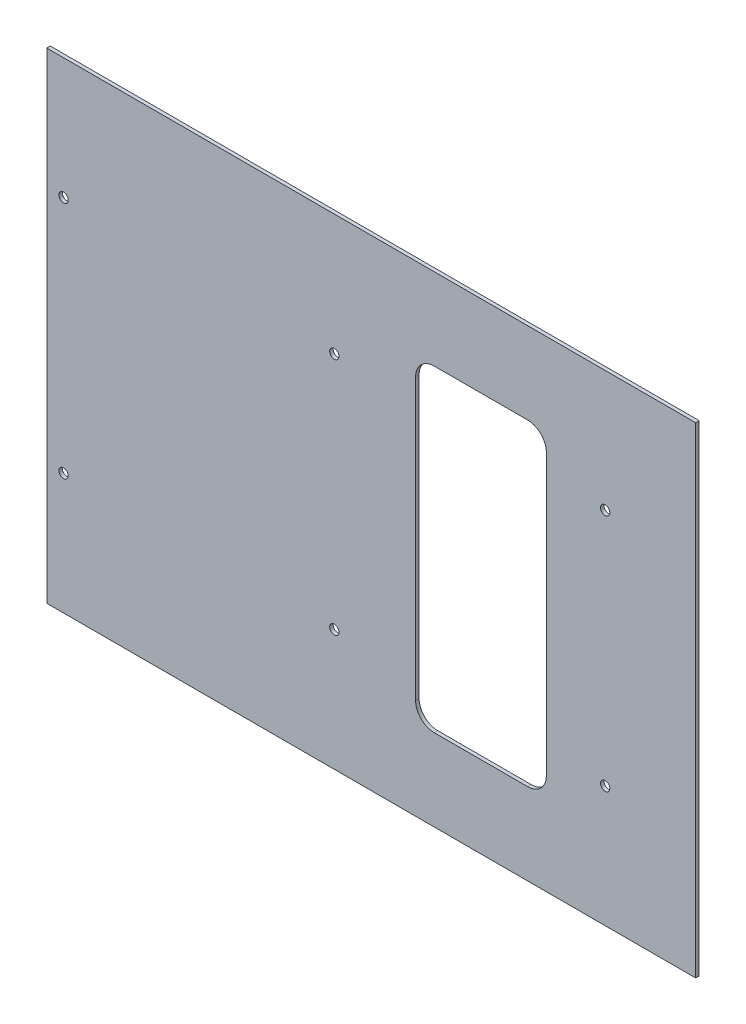
ISO-10303-21;
HEADER;
FILE_DESCRIPTION(('STEP AP214'),'2;1');
FILE_NAME('part.step','',(''),(''),'','','');
FILE_SCHEMA(('AUTOMOTIVE_DESIGN { 1 0 10303 214 1 1 1 1 }'));
ENDSEC;
DATA;
#1=APPLICATION_CONTEXT('core data for automotive mechanical design processes');
#2=APPLICATION_PROTOCOL_DEFINITION('international standard','automotive_design',2000,#1);
#3=PRODUCT_CONTEXT('',#1,'mechanical');
#4=PRODUCT('Part','Part','',(#3));
#5=PRODUCT_RELATED_PRODUCT_CATEGORY('part','',(#4));
#6=PRODUCT_DEFINITION_FORMATION('','',#4);
#7=PRODUCT_DEFINITION_CONTEXT('part definition',#1,'design');
#8=PRODUCT_DEFINITION('design','',#6,#7);
#9=PRODUCT_DEFINITION_SHAPE('','',#8);
#10=(LENGTH_UNIT() NAMED_UNIT(*) SI_UNIT(.MILLI.,.METRE.));
#11=(NAMED_UNIT(*) PLANE_ANGLE_UNIT() SI_UNIT($,.RADIAN.));
#12=(NAMED_UNIT(*) SI_UNIT($,.STERADIAN.) SOLID_ANGLE_UNIT());
#13=UNCERTAINTY_MEASURE_WITH_UNIT(LENGTH_MEASURE(1.E-05),#10,'distance_accuracy_value','');
#14=(GEOMETRIC_REPRESENTATION_CONTEXT(3) GLOBAL_UNCERTAINTY_ASSIGNED_CONTEXT((#13)) GLOBAL_UNIT_ASSIGNED_CONTEXT((#10,
#11,#12)) REPRESENTATION_CONTEXT('',''));
#15=CARTESIAN_POINT('',(0.,0.,0.));
#16=DIRECTION('',(0.,0.,1.));
#17=DIRECTION('',(1.,0.,0.));
#18=AXIS2_PLACEMENT_3D('',#15,#16,#17);
#19=CARTESIAN_POINT('',(-393.700000000001,-235.425000000004,4.7625));
#20=DIRECTION('',(-1.,0.,0.));
#21=DIRECTION('',(0.,0.,1.));
#22=AXIS2_PLACEMENT_3D('',#19,#20,#21);
#23=PLANE('',#22);
#24=DIRECTION('',(0.,1.,0.));
#25=VECTOR('',#24,1.);
#26=CARTESIAN_POINT('',(-393.700000000001,-235.425000000004,0.));
#27=LINE('',#26,#25);
#28=CARTESIAN_POINT('',(-393.700000000001,-235.425000000004,0.));
#29=VERTEX_POINT('',#28);
#30=CARTESIAN_POINT('',(-393.700000000001,418.624999999996,0.));
#31=VERTEX_POINT('',#30);
#32=EDGE_CURVE('E145',#29,#31,#27,.T.);
#33=ORIENTED_EDGE('',*,*,#32,.T.);
#34=DIRECTION('',(0.,0.,-1.));
#35=VECTOR('',#34,1.);
#36=CARTESIAN_POINT('',(-393.700000000001,418.624999999996,4.7625));
#37=LINE('',#36,#35);
#38=CARTESIAN_POINT('',(-393.700000000001,418.624999999996,4.7625));
#39=VERTEX_POINT('',#38);
#40=EDGE_CURVE('E126',#39,#31,#37,.T.);
#41=ORIENTED_EDGE('',*,*,#40,.F.);
#42=DIRECTION('',(0.,1.,0.));
#43=VECTOR('',#42,1.);
#44=CARTESIAN_POINT('',(-393.700000000001,-235.425000000004,4.7625));
#45=LINE('',#44,#43);
#46=CARTESIAN_POINT('',(-393.700000000001,-235.425000000004,4.7625));
#47=VERTEX_POINT('',#46);
#48=EDGE_CURVE('E133',#47,#39,#45,.T.);
#49=ORIENTED_EDGE('',*,*,#48,.F.);
#50=DIRECTION('',(0.,0.,-1.));
#51=VECTOR('',#50,1.);
#52=CARTESIAN_POINT('',(-393.700000000001,-235.425000000004,4.7625));
#53=LINE('',#52,#51);
#54=EDGE_CURVE('E254',#47,#29,#53,.T.);
#55=ORIENTED_EDGE('',*,*,#54,.T.);
#56=EDGE_LOOP('',(#33,#41,#49,#55));
#57=FACE_BOUND('',#56,.T.);
#58=ADVANCED_FACE('F33',(#57),#23,.F.);
#59=CARTESIAN_POINT('',(-393.700000000001,418.624999999996,4.7625));
#60=DIRECTION('',(0.,-1.,0.));
#61=DIRECTION('',(1.,0.,0.));
#62=AXIS2_PLACEMENT_3D('',#59,#60,#61);
#63=PLANE('',#62);
#64=DIRECTION('',(-1.,0.,0.));
#65=VECTOR('',#64,1.);
#66=CARTESIAN_POINT('',(-393.700000000001,418.624999999996,0.));
#67=LINE('',#66,#65);
#68=CARTESIAN_POINT('',(-1276.35,418.624999999996,0.));
#69=VERTEX_POINT('',#68);
#70=EDGE_CURVE('E256',#31,#69,#67,.T.);
#71=ORIENTED_EDGE('',*,*,#70,.T.);
#72=DIRECTION('',(0.,0.,-1.));
#73=VECTOR('',#72,1.);
#74=CARTESIAN_POINT('',(-1276.35,418.624999999996,4.7625));
#75=LINE('',#74,#73);
#76=CARTESIAN_POINT('',(-1276.35,418.624999999996,4.7625));
#77=VERTEX_POINT('',#76);
#78=EDGE_CURVE('E129',#77,#69,#75,.T.);
#79=ORIENTED_EDGE('',*,*,#78,.F.);
#80=DIRECTION('',(-1.,0.,0.));
#81=VECTOR('',#80,1.);
#82=CARTESIAN_POINT('',(-393.700000000001,418.624999999996,4.7625));
#83=LINE('',#82,#81);
#84=EDGE_CURVE('E122',#39,#77,#83,.T.);
#85=ORIENTED_EDGE('',*,*,#84,.F.);
#86=ORIENTED_EDGE('',*,*,#40,.T.);
#87=EDGE_LOOP('',(#71,#79,#85,#86));
#88=FACE_BOUND('',#87,.T.);
#89=ADVANCED_FACE('F124',(#88),#63,.F.);
#90=CARTESIAN_POINT('',(-1276.35,-235.425000000004,4.7625));
#91=DIRECTION('',(1.,0.,0.));
#92=DIRECTION('',(0.,0.,-1.));
#93=AXIS2_PLACEMENT_3D('',#90,#91,#92);
#94=PLANE('',#93);
#95=DIRECTION('',(0.,-1.,0.));
#96=VECTOR('',#95,1.);
#97=CARTESIAN_POINT('',(-1276.35,-235.425000000004,0.));
#98=LINE('',#97,#96);
#99=CARTESIAN_POINT('',(-1276.35,-235.425000000004,0.));
#100=VERTEX_POINT('',#99);
#101=EDGE_CURVE('E258',#69,#100,#98,.T.);
#102=ORIENTED_EDGE('',*,*,#101,.T.);
#103=DIRECTION('',(0.,0.,-1.));
#104=VECTOR('',#103,1.);
#105=CARTESIAN_POINT('',(-1276.35,-235.425000000004,4.7625));
#106=LINE('',#105,#104);
#107=CARTESIAN_POINT('',(-1276.35,-235.425000000004,4.7625));
#108=VERTEX_POINT('',#107);
#109=EDGE_CURVE('E150',#108,#100,#106,.T.);
#110=ORIENTED_EDGE('',*,*,#109,.F.);
#111=DIRECTION('',(0.,-1.,0.));
#112=VECTOR('',#111,1.);
#113=CARTESIAN_POINT('',(-1276.35,-235.425000000004,4.7625));
#114=LINE('',#113,#112);
#115=EDGE_CURVE('E132',#77,#108,#114,.T.);
#116=ORIENTED_EDGE('',*,*,#115,.F.);
#117=ORIENTED_EDGE('',*,*,#78,.T.);
#118=EDGE_LOOP('',(#102,#110,#116,#117));
#119=FACE_BOUND('',#118,.T.);
#120=ADVANCED_FACE('F270',(#119),#94,.F.);
#121=CARTESIAN_POINT('',(-393.700000000001,-235.425000000004,4.7625));
#122=DIRECTION('',(0.,1.,0.));
#123=DIRECTION('',(-1.,0.,0.));
#124=AXIS2_PLACEMENT_3D('',#121,#122,#123);
#125=PLANE('',#124);
#126=DIRECTION('',(1.,0.,0.));
#127=VECTOR('',#126,1.);
#128=CARTESIAN_POINT('',(-393.700000000001,-235.425000000004,0.));
#129=LINE('',#128,#127);
#130=EDGE_CURVE('E142',#100,#29,#129,.T.);
#131=ORIENTED_EDGE('',*,*,#130,.T.);
#132=ORIENTED_EDGE('',*,*,#54,.F.);
#133=DIRECTION('',(1.,0.,0.));
#134=VECTOR('',#133,1.);
#135=CARTESIAN_POINT('',(-393.700000000001,-235.425000000004,4.7625));
#136=LINE('',#135,#134);
#137=EDGE_CURVE('E138',#108,#47,#136,.T.);
#138=ORIENTED_EDGE('',*,*,#137,.F.);
#139=ORIENTED_EDGE('',*,*,#109,.T.);
#140=EDGE_LOOP('',(#131,#132,#138,#139));
#141=FACE_BOUND('',#140,.T.);
#142=ADVANCED_FACE('F265',(#141),#125,.F.);
#143=CARTESIAN_POINT('',(-393.700000000001,418.624999999996,4.7625));
#144=DIRECTION('',(0.,0.,1.));
#145=DIRECTION('',(1.,0.,0.));
#146=AXIS2_PLACEMENT_3D('',#143,#144,#145);
#147=PLANE('',#146);
#148=DIRECTION('',(0.,1.,0.));
#149=VECTOR('',#148,1.);
#150=CARTESIAN_POINT('',(-596.900000000001,307.499999999996,4.7625));
#151=LINE('',#150,#149);
#152=CARTESIAN_POINT('',(-596.900000000001,-98.900000000004,4.7625));
#153=VERTEX_POINT('',#152);
#154=CARTESIAN_POINT('',(-596.900000000001,282.099999999996,4.7625));
#155=VERTEX_POINT('',#154);
#156=EDGE_CURVE('E186',#153,#155,#151,.T.);
#157=ORIENTED_EDGE('',*,*,#156,.F.);
#158=CARTESIAN_POINT('',(-622.300000000001,-98.9000000000041,4.7625));
#159=DIRECTION('',(0.,0.,1.));
#160=DIRECTION('',(1.,0.,0.));
#161=AXIS2_PLACEMENT_3D('',#158,#159,#160);
#162=CIRCLE('',#161,25.4);
#163=CARTESIAN_POINT('',(-622.300000000001,-124.300000000004,4.7625));
#164=VERTEX_POINT('',#163);
#165=EDGE_CURVE('E174',#153,#164,#162,.F.);
#166=ORIENTED_EDGE('',*,*,#165,.T.);
#167=DIRECTION('',(1.,0.,0.));
#168=VECTOR('',#167,1.);
#169=CARTESIAN_POINT('',(-596.900000000001,-124.300000000004,4.7625));
#170=LINE('',#169,#168);
#171=CARTESIAN_POINT('',(-749.300000000001,-124.300000000004,4.7625));
#172=VERTEX_POINT('',#171);
#173=EDGE_CURVE('E205',#172,#164,#170,.T.);
#174=ORIENTED_EDGE('',*,*,#173,.F.);
#175=CARTESIAN_POINT('',(-749.300000000001,-98.9000000000041,4.7625));
#176=DIRECTION('',(0.,0.,1.));
#177=DIRECTION('',(1.,0.,0.));
#178=AXIS2_PLACEMENT_3D('',#175,#176,#177);
#179=CIRCLE('',#178,25.4);
#180=CARTESIAN_POINT('',(-774.700000000001,-98.9000000000042,4.7625));
#181=VERTEX_POINT('',#180);
#182=EDGE_CURVE('E170',#172,#181,#179,.F.);
#183=ORIENTED_EDGE('',*,*,#182,.T.);
#184=DIRECTION('',(0.,-1.,0.));
#185=VECTOR('',#184,1.);
#186=CARTESIAN_POINT('',(-774.700000000001,307.499999999996,4.7625));
#187=LINE('',#186,#185);
#188=CARTESIAN_POINT('',(-774.700000000001,282.099999999996,4.7625));
#189=VERTEX_POINT('',#188);
#190=EDGE_CURVE('E212',#189,#181,#187,.T.);
#191=ORIENTED_EDGE('',*,*,#190,.F.);
#192=CARTESIAN_POINT('',(-749.300000000001,282.099999999996,4.7625));
#193=DIRECTION('',(0.,0.,1.));
#194=DIRECTION('',(1.,0.,0.));
#195=AXIS2_PLACEMENT_3D('',#192,#193,#194);
#196=CIRCLE('',#195,25.4);
#197=CARTESIAN_POINT('',(-749.300000000001,307.499999999996,4.7625));
#198=VERTEX_POINT('',#197);
#199=EDGE_CURVE('E178',#189,#198,#196,.F.);
#200=ORIENTED_EDGE('',*,*,#199,.T.);
#201=DIRECTION('',(-1.,0.,0.));
#202=VECTOR('',#201,1.);
#203=CARTESIAN_POINT('',(-596.900000000001,307.499999999996,4.7625));
#204=LINE('',#203,#202);
#205=CARTESIAN_POINT('',(-622.300000000001,307.499999999996,4.7625));
#206=VERTEX_POINT('',#205);
#207=EDGE_CURVE('E187',#206,#198,#204,.T.);
#208=ORIENTED_EDGE('',*,*,#207,.F.);
#209=CARTESIAN_POINT('',(-622.300000000001,282.099999999996,4.7625));
#210=DIRECTION('',(0.,0.,1.));
#211=DIRECTION('',(1.,0.,0.));
#212=AXIS2_PLACEMENT_3D('',#209,#210,#211);
#213=CIRCLE('',#212,25.4);
#214=EDGE_CURVE('E41',#206,#155,#213,.F.);
#215=ORIENTED_EDGE('',*,*,#214,.T.);
#216=EDGE_LOOP('',(#157,#166,#174,#183,#191,#200,#208,#215));
#217=FACE_BOUND('',#216,.T.);
#218=CARTESIAN_POINT('',(-1253.49,253.999999999993,4.7625));
#219=DIRECTION('',(0.,0.,-1.));
#220=DIRECTION('',(-1.,0.,0.));
#221=AXIS2_PLACEMENT_3D('',#218,#219,#220);
#222=CIRCLE('',#221,6.35000000000017);
#223=CARTESIAN_POINT('',(-1259.84,253.999999999993,4.7625));
#224=VERTEX_POINT('',#223);
#225=EDGE_CURVE('E217',#224,#224,#222,.T.);
#226=ORIENTED_EDGE('',*,*,#225,.T.);
#227=EDGE_LOOP('',(#226));
#228=FACE_BOUND('',#227,.T.);
#229=CARTESIAN_POINT('',(-1253.49,-70.8000000000146,4.7625));
#230=DIRECTION('',(0.,0.,-1.));
#231=DIRECTION('',(-1.,0.,0.));
#232=AXIS2_PLACEMENT_3D('',#229,#230,#231);
#233=CIRCLE('',#232,6.35000000000016);
#234=CARTESIAN_POINT('',(-1259.84,-70.8000000000146,4.7625));
#235=VERTEX_POINT('',#234);
#236=EDGE_CURVE('E223',#235,#235,#233,.T.);
#237=ORIENTED_EDGE('',*,*,#236,.T.);
#238=EDGE_LOOP('',(#237));
#239=FACE_BOUND('',#238,.T.);
#240=CARTESIAN_POINT('',(-885.190000000002,-70.8000000000146,4.7625));
#241=DIRECTION('',(0.,0.,-1.));
#242=DIRECTION('',(-1.,0.,0.));
#243=AXIS2_PLACEMENT_3D('',#240,#241,#242);
#244=CIRCLE('',#243,6.35000000000006);
#245=CARTESIAN_POINT('',(-891.540000000002,-70.8000000000146,4.7625));
#246=VERTEX_POINT('',#245);
#247=EDGE_CURVE('E229',#246,#246,#244,.T.);
#248=ORIENTED_EDGE('',*,*,#247,.T.);
#249=EDGE_LOOP('',(#248));
#250=FACE_BOUND('',#249,.T.);
#251=CARTESIAN_POINT('',(-885.19,253.999999999993,4.7625));
#252=DIRECTION('',(0.,0.,-1.));
#253=DIRECTION('',(-1.,0.,0.));
#254=AXIS2_PLACEMENT_3D('',#251,#252,#253);
#255=CIRCLE('',#254,6.34999999999994);
#256=CARTESIAN_POINT('',(-891.54,253.999999999993,4.7625));
#257=VERTEX_POINT('',#256);
#258=EDGE_CURVE('E235',#257,#257,#255,.T.);
#259=ORIENTED_EDGE('',*,*,#258,.T.);
#260=EDGE_LOOP('',(#259));
#261=FACE_BOUND('',#260,.T.);
#262=CARTESIAN_POINT('',(-516.890000000002,-70.8000000000146,4.7625));
#263=DIRECTION('',(0.,0.,-1.));
#264=DIRECTION('',(-1.,0.,0.));
#265=AXIS2_PLACEMENT_3D('',#262,#263,#264);
#266=CIRCLE('',#265,6.34999999999994);
#267=CARTESIAN_POINT('',(-523.240000000002,-70.8000000000146,4.7625));
#268=VERTEX_POINT('',#267);
#269=EDGE_CURVE('E241',#268,#268,#266,.T.);
#270=ORIENTED_EDGE('',*,*,#269,.T.);
#271=EDGE_LOOP('',(#270));
#272=FACE_BOUND('',#271,.T.);
#273=CARTESIAN_POINT('',(-516.89,253.999999999993,4.7625));
#274=DIRECTION('',(0.,0.,-1.));
#275=DIRECTION('',(-1.,0.,0.));
#276=AXIS2_PLACEMENT_3D('',#273,#274,#275);
#277=CIRCLE('',#276,6.34999999999994);
#278=CARTESIAN_POINT('',(-523.24,253.999999999993,4.7625));
#279=VERTEX_POINT('',#278);
#280=EDGE_CURVE('E247',#279,#279,#277,.T.);
#281=ORIENTED_EDGE('',*,*,#280,.T.);
#282=EDGE_LOOP('',(#281));
#283=FACE_BOUND('',#282,.T.);
#284=ORIENTED_EDGE('',*,*,#48,.T.);
#285=ORIENTED_EDGE('',*,*,#84,.T.);
#286=ORIENTED_EDGE('',*,*,#115,.T.);
#287=ORIENTED_EDGE('',*,*,#137,.T.);
#288=EDGE_LOOP('',(#284,#285,#286,#287));
#289=FACE_BOUND('',#288,.T.);
#290=ADVANCED_FACE('F136',(#217,#228,#239,#250,#261,#272,#283,#289),#147,.T.);
#291=CARTESIAN_POINT('',(-393.700000000001,418.624999999996,0.));
#292=DIRECTION('',(0.,0.,1.));
#293=DIRECTION('',(1.,0.,0.));
#294=AXIS2_PLACEMENT_3D('',#291,#292,#293);
#295=PLANE('',#294);
#296=DIRECTION('',(0.,-1.,0.));
#297=VECTOR('',#296,1.);
#298=CARTESIAN_POINT('',(-774.700000000001,307.499999999996,0.));
#299=LINE('',#298,#297);
#300=CARTESIAN_POINT('',(-774.700000000001,282.099999999996,0.));
#301=VERTEX_POINT('',#300);
#302=CARTESIAN_POINT('',(-774.700000000001,-98.9000000000042,0.));
#303=VERTEX_POINT('',#302);
#304=EDGE_CURVE('E199',#301,#303,#299,.T.);
#305=ORIENTED_EDGE('',*,*,#304,.T.);
#306=CARTESIAN_POINT('',(-749.300000000001,-98.9000000000041,0.));
#307=DIRECTION('',(0.,0.,1.));
#308=DIRECTION('',(1.,0.,0.));
#309=AXIS2_PLACEMENT_3D('',#306,#307,#308);
#310=CIRCLE('',#309,25.4);
#311=CARTESIAN_POINT('',(-749.300000000001,-124.300000000004,0.));
#312=VERTEX_POINT('',#311);
#313=EDGE_CURVE('E172',#303,#312,#310,.T.);
#314=ORIENTED_EDGE('',*,*,#313,.T.);
#315=DIRECTION('',(1.,0.,0.));
#316=VECTOR('',#315,1.);
#317=CARTESIAN_POINT('',(-596.900000000001,-124.300000000004,0.));
#318=LINE('',#317,#316);
#319=CARTESIAN_POINT('',(-622.300000000001,-124.300000000004,0.));
#320=VERTEX_POINT('',#319);
#321=EDGE_CURVE('E203',#312,#320,#318,.T.);
#322=ORIENTED_EDGE('',*,*,#321,.T.);
#323=CARTESIAN_POINT('',(-622.300000000001,-98.9000000000041,0.));
#324=DIRECTION('',(0.,0.,1.));
#325=DIRECTION('',(1.,0.,0.));
#326=AXIS2_PLACEMENT_3D('',#323,#324,#325);
#327=CIRCLE('',#326,25.4);
#328=CARTESIAN_POINT('',(-596.900000000001,-98.900000000004,0.));
#329=VERTEX_POINT('',#328);
#330=EDGE_CURVE('E176',#320,#329,#327,.T.);
#331=ORIENTED_EDGE('',*,*,#330,.T.);
#332=DIRECTION('',(0.,1.,0.));
#333=VECTOR('',#332,1.);
#334=CARTESIAN_POINT('',(-596.900000000001,307.499999999996,0.));
#335=LINE('',#334,#333);
#336=CARTESIAN_POINT('',(-596.900000000001,282.099999999996,0.));
#337=VERTEX_POINT('',#336);
#338=EDGE_CURVE('E200',#329,#337,#335,.T.);
#339=ORIENTED_EDGE('',*,*,#338,.T.);
#340=CARTESIAN_POINT('',(-622.300000000001,282.099999999996,0.));
#341=DIRECTION('',(0.,0.,1.));
#342=DIRECTION('',(1.,0.,0.));
#343=AXIS2_PLACEMENT_3D('',#340,#341,#342);
#344=CIRCLE('',#343,25.4);
#345=CARTESIAN_POINT('',(-622.300000000001,307.499999999996,0.));
#346=VERTEX_POINT('',#345);
#347=EDGE_CURVE('E11',#337,#346,#344,.T.);
#348=ORIENTED_EDGE('',*,*,#347,.T.);
#349=DIRECTION('',(-1.,0.,0.));
#350=VECTOR('',#349,1.);
#351=CARTESIAN_POINT('',(-596.900000000001,307.499999999996,0.));
#352=LINE('',#351,#350);
#353=CARTESIAN_POINT('',(-749.300000000001,307.499999999996,0.));
#354=VERTEX_POINT('',#353);
#355=EDGE_CURVE('E197',#346,#354,#352,.T.);
#356=ORIENTED_EDGE('',*,*,#355,.T.);
#357=CARTESIAN_POINT('',(-749.300000000001,282.099999999996,0.));
#358=DIRECTION('',(0.,0.,1.));
#359=DIRECTION('',(1.,0.,0.));
#360=AXIS2_PLACEMENT_3D('',#357,#358,#359);
#361=CIRCLE('',#360,25.4);
#362=EDGE_CURVE('E180',#354,#301,#361,.T.);
#363=ORIENTED_EDGE('',*,*,#362,.T.);
#364=EDGE_LOOP('',(#305,#314,#322,#331,#339,#348,#356,#363));
#365=FACE_BOUND('',#364,.T.);
#366=CARTESIAN_POINT('',(-1253.49,253.999999999993,0.));
#367=DIRECTION('',(0.,0.,-1.));
#368=DIRECTION('',(-1.,0.,0.));
#369=AXIS2_PLACEMENT_3D('',#366,#367,#368);
#370=CIRCLE('',#369,6.35000000000017);
#371=CARTESIAN_POINT('',(-1259.84,253.999999999993,0.));
#372=VERTEX_POINT('',#371);
#373=EDGE_CURVE('E209',#372,#372,#370,.T.);
#374=ORIENTED_EDGE('',*,*,#373,.F.);
#375=EDGE_LOOP('',(#374));
#376=FACE_BOUND('',#375,.T.);
#377=CARTESIAN_POINT('',(-1253.49,-70.8000000000146,0.));
#378=DIRECTION('',(0.,0.,-1.));
#379=DIRECTION('',(-1.,0.,0.));
#380=AXIS2_PLACEMENT_3D('',#377,#378,#379);
#381=CIRCLE('',#380,6.35000000000016);
#382=CARTESIAN_POINT('',(-1259.84,-70.8000000000146,0.));
#383=VERTEX_POINT('',#382);
#384=EDGE_CURVE('E220',#383,#383,#381,.T.);
#385=ORIENTED_EDGE('',*,*,#384,.F.);
#386=EDGE_LOOP('',(#385));
#387=FACE_BOUND('',#386,.T.);
#388=CARTESIAN_POINT('',(-885.190000000002,-70.8000000000146,0.));
#389=DIRECTION('',(0.,0.,-1.));
#390=DIRECTION('',(-1.,0.,0.));
#391=AXIS2_PLACEMENT_3D('',#388,#389,#390);
#392=CIRCLE('',#391,6.35000000000006);
#393=CARTESIAN_POINT('',(-891.540000000002,-70.8000000000146,0.));
#394=VERTEX_POINT('',#393);
#395=EDGE_CURVE('E226',#394,#394,#392,.T.);
#396=ORIENTED_EDGE('',*,*,#395,.F.);
#397=EDGE_LOOP('',(#396));
#398=FACE_BOUND('',#397,.T.);
#399=CARTESIAN_POINT('',(-885.19,253.999999999993,0.));
#400=DIRECTION('',(0.,0.,-1.));
#401=DIRECTION('',(-1.,0.,0.));
#402=AXIS2_PLACEMENT_3D('',#399,#400,#401);
#403=CIRCLE('',#402,6.34999999999994);
#404=CARTESIAN_POINT('',(-891.54,253.999999999993,0.));
#405=VERTEX_POINT('',#404);
#406=EDGE_CURVE('E232',#405,#405,#403,.T.);
#407=ORIENTED_EDGE('',*,*,#406,.F.);
#408=EDGE_LOOP('',(#407));
#409=FACE_BOUND('',#408,.T.);
#410=CARTESIAN_POINT('',(-516.890000000002,-70.8000000000146,0.));
#411=DIRECTION('',(0.,0.,-1.));
#412=DIRECTION('',(-1.,0.,0.));
#413=AXIS2_PLACEMENT_3D('',#410,#411,#412);
#414=CIRCLE('',#413,6.34999999999994);
#415=CARTESIAN_POINT('',(-523.240000000002,-70.8000000000146,0.));
#416=VERTEX_POINT('',#415);
#417=EDGE_CURVE('E238',#416,#416,#414,.T.);
#418=ORIENTED_EDGE('',*,*,#417,.F.);
#419=EDGE_LOOP('',(#418));
#420=FACE_BOUND('',#419,.T.);
#421=CARTESIAN_POINT('',(-516.89,253.999999999993,0.));
#422=DIRECTION('',(0.,0.,-1.));
#423=DIRECTION('',(-1.,0.,0.));
#424=AXIS2_PLACEMENT_3D('',#421,#422,#423);
#425=CIRCLE('',#424,6.34999999999994);
#426=CARTESIAN_POINT('',(-523.24,253.999999999993,0.));
#427=VERTEX_POINT('',#426);
#428=EDGE_CURVE('E244',#427,#427,#425,.T.);
#429=ORIENTED_EDGE('',*,*,#428,.F.);
#430=EDGE_LOOP('',(#429));
#431=FACE_BOUND('',#430,.T.);
#432=ORIENTED_EDGE('',*,*,#32,.F.);
#433=ORIENTED_EDGE('',*,*,#130,.F.);
#434=ORIENTED_EDGE('',*,*,#101,.F.);
#435=ORIENTED_EDGE('',*,*,#70,.F.);
#436=EDGE_LOOP('',(#432,#433,#434,#435));
#437=FACE_BOUND('',#436,.T.);
#438=ADVANCED_FACE('F269',(#365,#376,#387,#398,#409,#420,#431,#437),#295,.F.);
#439=CARTESIAN_POINT('',(-516.89,253.999999999993,4.7625));
#440=DIRECTION('',(0.,0.,-1.));
#441=DIRECTION('',(-1.,0.,0.));
#442=AXIS2_PLACEMENT_3D('',#439,#440,#441);
#443=CYLINDRICAL_SURFACE('',#442,6.34999999999994);
#444=ORIENTED_EDGE('',*,*,#280,.F.);
#445=EDGE_LOOP('',(#444));
#446=FACE_BOUND('',#445,.T.);
#447=ORIENTED_EDGE('',*,*,#428,.T.);
#448=EDGE_LOOP('',(#447));
#449=FACE_BOUND('',#448,.T.);
#450=ADVANCED_FACE('F342',(#446,#449),#443,.F.);
#451=CARTESIAN_POINT('',(-516.890000000002,-70.8000000000146,4.7625));
#452=DIRECTION('',(0.,0.,-1.));
#453=DIRECTION('',(-1.,0.,0.));
#454=AXIS2_PLACEMENT_3D('',#451,#452,#453);
#455=CYLINDRICAL_SURFACE('',#454,6.34999999999994);
#456=ORIENTED_EDGE('',*,*,#269,.F.);
#457=EDGE_LOOP('',(#456));
#458=FACE_BOUND('',#457,.T.);
#459=ORIENTED_EDGE('',*,*,#417,.T.);
#460=EDGE_LOOP('',(#459));
#461=FACE_BOUND('',#460,.T.);
#462=ADVANCED_FACE('F338',(#458,#461),#455,.F.);
#463=CARTESIAN_POINT('',(-885.19,253.999999999993,4.7625));
#464=DIRECTION('',(0.,0.,-1.));
#465=DIRECTION('',(-1.,0.,0.));
#466=AXIS2_PLACEMENT_3D('',#463,#464,#465);
#467=CYLINDRICAL_SURFACE('',#466,6.34999999999994);
#468=ORIENTED_EDGE('',*,*,#258,.F.);
#469=EDGE_LOOP('',(#468));
#470=FACE_BOUND('',#469,.T.);
#471=ORIENTED_EDGE('',*,*,#406,.T.);
#472=EDGE_LOOP('',(#471));
#473=FACE_BOUND('',#472,.T.);
#474=ADVANCED_FACE('F334',(#470,#473),#467,.F.);
#475=CARTESIAN_POINT('',(-885.190000000002,-70.8000000000146,4.7625));
#476=DIRECTION('',(0.,0.,-1.));
#477=DIRECTION('',(-1.,0.,0.));
#478=AXIS2_PLACEMENT_3D('',#475,#476,#477);
#479=CYLINDRICAL_SURFACE('',#478,6.35000000000006);
#480=ORIENTED_EDGE('',*,*,#247,.F.);
#481=EDGE_LOOP('',(#480));
#482=FACE_BOUND('',#481,.T.);
#483=ORIENTED_EDGE('',*,*,#395,.T.);
#484=EDGE_LOOP('',(#483));
#485=FACE_BOUND('',#484,.T.);
#486=ADVANCED_FACE('F330',(#482,#485),#479,.F.);
#487=CARTESIAN_POINT('',(-1253.49,-70.8000000000146,4.7625));
#488=DIRECTION('',(0.,0.,-1.));
#489=DIRECTION('',(-1.,0.,0.));
#490=AXIS2_PLACEMENT_3D('',#487,#488,#489);
#491=CYLINDRICAL_SURFACE('',#490,6.35000000000016);
#492=ORIENTED_EDGE('',*,*,#236,.F.);
#493=EDGE_LOOP('',(#492));
#494=FACE_BOUND('',#493,.T.);
#495=ORIENTED_EDGE('',*,*,#384,.T.);
#496=EDGE_LOOP('',(#495));
#497=FACE_BOUND('',#496,.T.);
#498=ADVANCED_FACE('F326',(#494,#497),#491,.F.);
#499=CARTESIAN_POINT('',(-1253.49,253.999999999993,4.7625));
#500=DIRECTION('',(0.,0.,-1.));
#501=DIRECTION('',(-1.,0.,0.));
#502=AXIS2_PLACEMENT_3D('',#499,#500,#501);
#503=CYLINDRICAL_SURFACE('',#502,6.35000000000017);
#504=ORIENTED_EDGE('',*,*,#225,.F.);
#505=EDGE_LOOP('',(#504));
#506=FACE_BOUND('',#505,.T.);
#507=ORIENTED_EDGE('',*,*,#373,.T.);
#508=EDGE_LOOP('',(#507));
#509=FACE_BOUND('',#508,.T.);
#510=ADVANCED_FACE('F319',(#506,#509),#503,.F.);
#511=CARTESIAN_POINT('',(-596.900000000001,307.499999999996,0.));
#512=DIRECTION('',(1.,0.,0.));
#513=DIRECTION('',(0.,0.,-1.));
#514=AXIS2_PLACEMENT_3D('',#511,#512,#513);
#515=PLANE('',#514);
#516=ORIENTED_EDGE('',*,*,#338,.F.);
#517=DIRECTION('',(0.,0.,1.));
#518=VECTOR('',#517,1.);
#519=CARTESIAN_POINT('',(-596.900000000001,-98.9000000000041,4.7625));
#520=LINE('',#519,#518);
#521=EDGE_CURVE('E163',#329,#153,#520,.T.);
#522=ORIENTED_EDGE('',*,*,#521,.T.);
#523=ORIENTED_EDGE('',*,*,#156,.T.);
#524=DIRECTION('',(0.,0.,1.));
#525=VECTOR('',#524,1.);
#526=CARTESIAN_POINT('',(-596.900000000001,282.099999999996,0.));
#527=LINE('',#526,#525);
#528=EDGE_CURVE('E161',#155,#337,#527,.F.);
#529=ORIENTED_EDGE('',*,*,#528,.T.);
#530=EDGE_LOOP('',(#516,#522,#523,#529));
#531=FACE_BOUND('',#530,.T.);
#532=ADVANCED_FACE('F193',(#531),#515,.F.);
#533=CARTESIAN_POINT('',(-596.900000000001,-124.300000000004,0.));
#534=DIRECTION('',(0.,-1.,0.));
#535=DIRECTION('',(1.,0.,0.));
#536=AXIS2_PLACEMENT_3D('',#533,#534,#535);
#537=PLANE('',#536);
#538=ORIENTED_EDGE('',*,*,#321,.F.);
#539=DIRECTION('',(0.,0.,1.));
#540=VECTOR('',#539,1.);
#541=CARTESIAN_POINT('',(-749.300000000001,-124.300000000004,4.7625));
#542=LINE('',#541,#540);
#543=EDGE_CURVE('E148',#312,#172,#542,.T.);
#544=ORIENTED_EDGE('',*,*,#543,.T.);
#545=ORIENTED_EDGE('',*,*,#173,.T.);
#546=DIRECTION('',(0.,0.,1.));
#547=VECTOR('',#546,1.);
#548=CARTESIAN_POINT('',(-622.300000000001,-124.300000000004,0.));
#549=LINE('',#548,#547);
#550=EDGE_CURVE('E146',#164,#320,#549,.F.);
#551=ORIENTED_EDGE('',*,*,#550,.T.);
#552=EDGE_LOOP('',(#538,#544,#545,#551));
#553=FACE_BOUND('',#552,.T.);
#554=ADVANCED_FACE('F309',(#553),#537,.F.);
#555=CARTESIAN_POINT('',(-774.700000000001,307.499999999996,0.));
#556=DIRECTION('',(-1.,0.,0.));
#557=DIRECTION('',(0.,0.,1.));
#558=AXIS2_PLACEMENT_3D('',#555,#556,#557);
#559=PLANE('',#558);
#560=ORIENTED_EDGE('',*,*,#190,.T.);
#561=DIRECTION('',(0.,0.,1.));
#562=VECTOR('',#561,1.);
#563=CARTESIAN_POINT('',(-774.700000000001,-98.9000000000041,0.));
#564=LINE('',#563,#562);
#565=EDGE_CURVE('E159',#181,#303,#564,.F.);
#566=ORIENTED_EDGE('',*,*,#565,.T.);
#567=ORIENTED_EDGE('',*,*,#304,.F.);
#568=DIRECTION('',(0.,0.,1.));
#569=VECTOR('',#568,1.);
#570=CARTESIAN_POINT('',(-774.700000000001,282.099999999996,4.7625));
#571=LINE('',#570,#569);
#572=EDGE_CURVE('E156',#301,#189,#571,.T.);
#573=ORIENTED_EDGE('',*,*,#572,.T.);
#574=EDGE_LOOP('',(#560,#566,#567,#573));
#575=FACE_BOUND('',#574,.T.);
#576=ADVANCED_FACE('F302',(#575),#559,.F.);
#577=CARTESIAN_POINT('',(-596.900000000001,307.499999999996,0.));
#578=DIRECTION('',(0.,1.,0.));
#579=DIRECTION('',(-1.,0.,0.));
#580=AXIS2_PLACEMENT_3D('',#577,#578,#579);
#581=PLANE('',#580);
#582=ORIENTED_EDGE('',*,*,#207,.T.);
#583=DIRECTION('',(0.,0.,1.));
#584=VECTOR('',#583,1.);
#585=CARTESIAN_POINT('',(-749.300000000001,307.499999999996,0.));
#586=LINE('',#585,#584);
#587=EDGE_CURVE('E48',#198,#354,#586,.F.);
#588=ORIENTED_EDGE('',*,*,#587,.T.);
#589=ORIENTED_EDGE('',*,*,#355,.F.);
#590=DIRECTION('',(0.,0.,1.));
#591=VECTOR('',#590,1.);
#592=CARTESIAN_POINT('',(-622.300000000001,307.499999999996,4.7625));
#593=LINE('',#592,#591);
#594=EDGE_CURVE('E166',#346,#206,#593,.T.);
#595=ORIENTED_EDGE('',*,*,#594,.T.);
#596=EDGE_LOOP('',(#582,#588,#589,#595));
#597=FACE_BOUND('',#596,.T.);
#598=ADVANCED_FACE('F196',(#597),#581,.F.);
#599=CARTESIAN_POINT('',(-749.300000000001,-98.9000000000041,0.));
#600=DIRECTION('',(0.,0.,-1.));
#601=DIRECTION('',(-1.,0.,0.));
#602=AXIS2_PLACEMENT_3D('',#599,#600,#601);
#603=CYLINDRICAL_SURFACE('',#602,25.4);
#604=ORIENTED_EDGE('',*,*,#313,.F.);
#605=ORIENTED_EDGE('',*,*,#565,.F.);
#606=ORIENTED_EDGE('',*,*,#182,.F.);
#607=ORIENTED_EDGE('',*,*,#543,.F.);
#608=EDGE_LOOP('',(#604,#605,#606,#607));
#609=FACE_BOUND('',#608,.T.);
#610=ADVANCED_FACE('F284',(#609),#603,.F.);
#611=CARTESIAN_POINT('',(-622.300000000001,-98.9000000000041,0.));
#612=DIRECTION('',(0.,0.,-1.));
#613=DIRECTION('',(-1.,0.,0.));
#614=AXIS2_PLACEMENT_3D('',#611,#612,#613);
#615=CYLINDRICAL_SURFACE('',#614,25.4);
#616=ORIENTED_EDGE('',*,*,#330,.F.);
#617=ORIENTED_EDGE('',*,*,#550,.F.);
#618=ORIENTED_EDGE('',*,*,#165,.F.);
#619=ORIENTED_EDGE('',*,*,#521,.F.);
#620=EDGE_LOOP('',(#616,#617,#618,#619));
#621=FACE_BOUND('',#620,.T.);
#622=ADVANCED_FACE('F287',(#621),#615,.F.);
#623=CARTESIAN_POINT('',(-749.300000000001,282.099999999996,0.));
#624=DIRECTION('',(0.,0.,-1.));
#625=DIRECTION('',(-1.,0.,0.));
#626=AXIS2_PLACEMENT_3D('',#623,#624,#625);
#627=CYLINDRICAL_SURFACE('',#626,25.4);
#628=ORIENTED_EDGE('',*,*,#362,.F.);
#629=ORIENTED_EDGE('',*,*,#587,.F.);
#630=ORIENTED_EDGE('',*,*,#199,.F.);
#631=ORIENTED_EDGE('',*,*,#572,.F.);
#632=EDGE_LOOP('',(#628,#629,#630,#631));
#633=FACE_BOUND('',#632,.T.);
#634=ADVANCED_FACE('F290',(#633),#627,.F.);
#635=CARTESIAN_POINT('',(-622.300000000001,282.099999999996,0.));
#636=DIRECTION('',(0.,0.,-1.));
#637=DIRECTION('',(-1.,0.,0.));
#638=AXIS2_PLACEMENT_3D('',#635,#636,#637);
#639=CYLINDRICAL_SURFACE('',#638,25.4);
#640=ORIENTED_EDGE('',*,*,#347,.F.);
#641=ORIENTED_EDGE('',*,*,#528,.F.);
#642=ORIENTED_EDGE('',*,*,#214,.F.);
#643=ORIENTED_EDGE('',*,*,#594,.F.);
#644=EDGE_LOOP('',(#640,#641,#642,#643));
#645=FACE_BOUND('',#644,.T.);
#646=ADVANCED_FACE('F35',(#645),#639,.F.);
#647=CLOSED_SHELL('',(#58,#89,#120,#142,#290,#438,#450,#462,#474,#486,#498,#510,#532,#554,#576,
#598,#610,#622,#634,#646));
#648=MANIFOLD_SOLID_BREP('B2',#647);
#649=ADVANCED_BREP_SHAPE_REPRESENTATION('',(#18,#648),#14);
#650=SHAPE_DEFINITION_REPRESENTATION(#9,#649);
ENDSEC;
END-ISO-10303-21;
